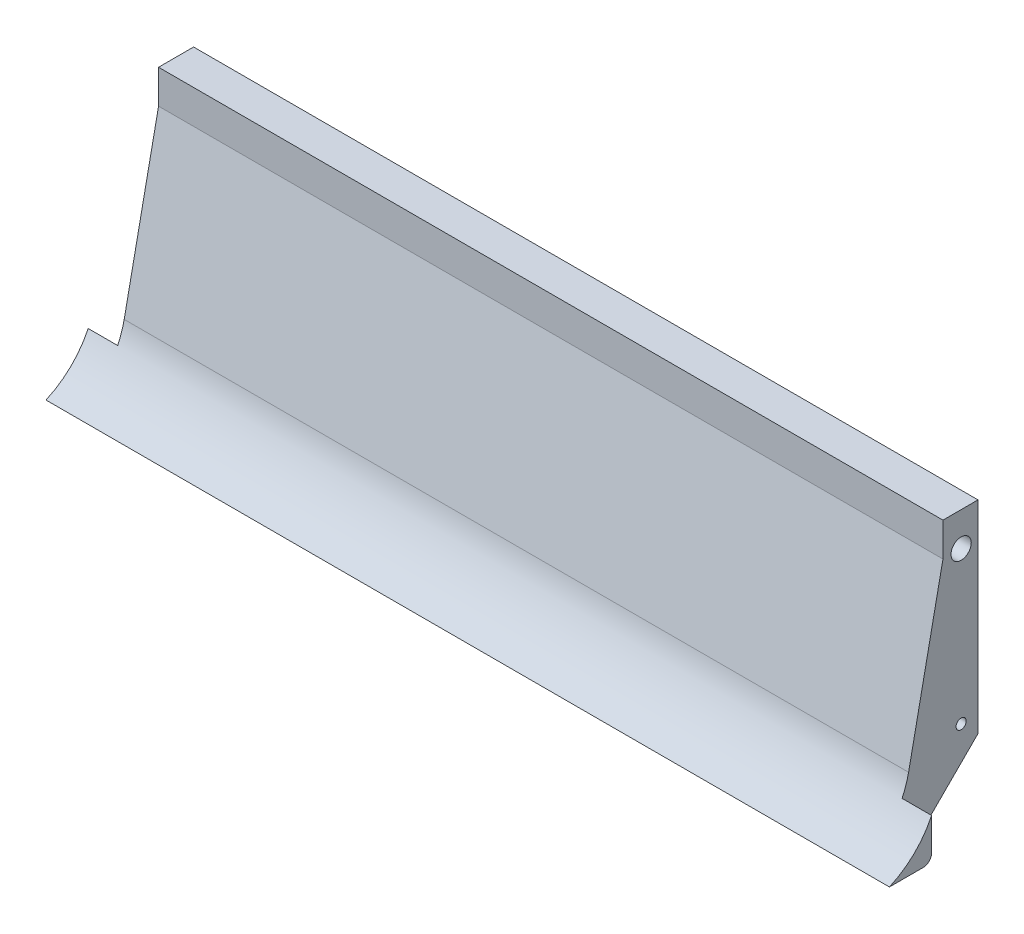
ISO-10303-21;
HEADER;
FILE_DESCRIPTION(('STEP AP214'),'2;1');
FILE_NAME('part.step','',(''),(''),'','','');
FILE_SCHEMA(('AUTOMOTIVE_DESIGN { 1 0 10303 214 1 1 1 1 }'));
ENDSEC;
DATA;
#1=APPLICATION_CONTEXT('core data for automotive mechanical design processes');
#2=APPLICATION_PROTOCOL_DEFINITION('international standard','automotive_design',2000,#1);
#3=PRODUCT_CONTEXT('',#1,'mechanical');
#4=PRODUCT('Part','Part','',(#3));
#5=PRODUCT_RELATED_PRODUCT_CATEGORY('part','',(#4));
#6=PRODUCT_DEFINITION_FORMATION('','',#4);
#7=PRODUCT_DEFINITION_CONTEXT('part definition',#1,'design');
#8=PRODUCT_DEFINITION('design','',#6,#7);
#9=PRODUCT_DEFINITION_SHAPE('','',#8);
#10=(LENGTH_UNIT() NAMED_UNIT(*) SI_UNIT(.MILLI.,.METRE.));
#11=(NAMED_UNIT(*) PLANE_ANGLE_UNIT() SI_UNIT($,.RADIAN.));
#12=(NAMED_UNIT(*) SI_UNIT($,.STERADIAN.) SOLID_ANGLE_UNIT());
#13=UNCERTAINTY_MEASURE_WITH_UNIT(LENGTH_MEASURE(1.E-05),#10,'distance_accuracy_value','');
#14=(GEOMETRIC_REPRESENTATION_CONTEXT(3) GLOBAL_UNCERTAINTY_ASSIGNED_CONTEXT((#13)) GLOBAL_UNIT_ASSIGNED_CONTEXT((#10,
#11,#12)) REPRESENTATION_CONTEXT('',''));
#15=CARTESIAN_POINT('',(0.,0.,0.));
#16=DIRECTION('',(0.,0.,1.));
#17=DIRECTION('',(1.,0.,0.));
#18=AXIS2_PLACEMENT_3D('',#15,#16,#17);
#19=CARTESIAN_POINT('',(0.,-8.95200122399586,15.5116568960203));
#20=DIRECTION('',(0.,-0.200951276235461,-0.97960123753461));
#21=DIRECTION('',(0.,0.97960123753461,-0.200951276235461));
#22=AXIS2_PLACEMENT_3D('',#19,#20,#21);
#23=PLANE('',#22);
#24=DIRECTION('',(1.,0.,0.));
#25=VECTOR('',#24,1.);
#26=CARTESIAN_POINT('',(0.,-3.05308900706619,14.3015788632727));
#27=LINE('',#26,#25);
#28=CARTESIAN_POINT('',(3.5,-3.05308900706619,14.3015788632727));
#29=VERTEX_POINT('',#28);
#30=CARTESIAN_POINT('',(96.5,-3.05308900706619,14.3015788632727));
#31=VERTEX_POINT('',#30);
#32=EDGE_CURVE('E161',#29,#31,#27,.T.);
#33=ORIENTED_EDGE('',*,*,#32,.T.);
#34=DIRECTION('',(0.,0.97960123753461,-0.200951276235461));
#35=VECTOR('',#34,1.);
#36=CARTESIAN_POINT('',(96.5,-8.95200122399586,15.5116568960203));
#37=LINE('',#36,#35);
#38=CARTESIAN_POINT('',(96.5,16.8022026708873,10.22854786879));
#39=VERTEX_POINT('',#38);
#40=EDGE_CURVE('E271',#31,#39,#37,.T.);
#41=ORIENTED_EDGE('',*,*,#40,.T.);
#42=DIRECTION('',(1.,0.,0.));
#43=VECTOR('',#42,1.);
#44=CARTESIAN_POINT('',(0.,16.8022026708873,10.22854786879));
#45=LINE('',#44,#43);
#46=CARTESIAN_POINT('',(3.5,16.8022026708873,10.22854786879));
#47=VERTEX_POINT('',#46);
#48=EDGE_CURVE('E177',#47,#39,#45,.T.);
#49=ORIENTED_EDGE('',*,*,#48,.F.);
#50=DIRECTION('',(0.,0.97960123753461,-0.200951276235461));
#51=VECTOR('',#50,1.);
#52=CARTESIAN_POINT('',(3.5,-8.95200122399586,15.5116568960203));
#53=LINE('',#52,#51);
#54=EDGE_CURVE('E222',#29,#47,#53,.T.);
#55=ORIENTED_EDGE('',*,*,#54,.F.);
#56=EDGE_LOOP('',(#33,#41,#49,#55));
#57=FACE_BOUND('',#56,.T.);
#58=ADVANCED_FACE('F33',(#57),#23,.F.);
#59=CARTESIAN_POINT('',(100.,-3.19779732911274,6.07263951991399));
#60=DIRECTION('',(0.,0.707106781186548,0.707106781186547));
#61=DIRECTION('',(-1.,0.,0.));
#62=AXIS2_PLACEMENT_3D('',#59,#60,#61);
#63=PLANE('',#62);
#64=DIRECTION('',(0.,-0.707106781186547,0.707106781186548));
#65=VECTOR('',#64,1.);
#66=CARTESIAN_POINT('',(96.5,-3.19779732911274,6.07263951991399));
#67=LINE('',#66,#65);
#68=CARTESIAN_POINT('',(96.5,-8.73333123504549,11.6081734258468));
#69=VERTEX_POINT('',#68);
#70=CARTESIAN_POINT('',(96.5,-3.19779732911273,6.07263951991399));
#71=VERTEX_POINT('',#70);
#72=EDGE_CURVE('E224',#69,#71,#67,.F.);
#73=ORIENTED_EDGE('',*,*,#72,.F.);
#74=DIRECTION('',(1.,0.,0.));
#75=VECTOR('',#74,1.);
#76=CARTESIAN_POINT('',(3.5,-8.73333123504549,11.6081734258467));
#77=LINE('',#76,#75);
#78=CARTESIAN_POINT('',(3.5,-8.73333123504549,11.6081734258468));
#79=VERTEX_POINT('',#78);
#80=EDGE_CURVE('E293',#69,#79,#77,.F.);
#81=ORIENTED_EDGE('',*,*,#80,.T.);
#82=DIRECTION('',(0.,-0.707106781186547,0.707106781186548));
#83=VECTOR('',#82,1.);
#84=CARTESIAN_POINT('',(3.5,-3.19779732911274,6.07263951991399));
#85=LINE('',#84,#83);
#86=CARTESIAN_POINT('',(3.5,-3.19779732911273,6.07263951991399));
#87=VERTEX_POINT('',#86);
#88=EDGE_CURVE('E220',#79,#87,#85,.F.);
#89=ORIENTED_EDGE('',*,*,#88,.T.);
#90=DIRECTION('',(-1.,0.,0.));
#91=VECTOR('',#90,1.);
#92=CARTESIAN_POINT('',(100.,-3.19779732911274,6.07263951991399));
#93=LINE('',#92,#91);
#94=EDGE_CURVE('E164',#71,#87,#93,.T.);
#95=ORIENTED_EDGE('',*,*,#94,.F.);
#96=EDGE_LOOP('',(#73,#81,#89,#95));
#97=FACE_BOUND('',#96,.T.);
#98=ADVANCED_FACE('F301',(#97),#63,.F.);
#99=CARTESIAN_POINT('',(100.,16.8022026708873,6.07263951991399));
#100=DIRECTION('',(0.,0.,1.));
#101=DIRECTION('',(0.,-1.,0.));
#102=AXIS2_PLACEMENT_3D('',#99,#100,#101);
#103=PLANE('',#102);
#104=ORIENTED_EDGE('',*,*,#94,.T.);
#105=DIRECTION('',(0.,-1.,0.));
#106=VECTOR('',#105,1.);
#107=CARTESIAN_POINT('',(3.5,20.8022026708873,6.07263951991399));
#108=LINE('',#107,#106);
#109=CARTESIAN_POINT('',(3.5,20.8022026708873,6.07263951991399));
#110=VERTEX_POINT('',#109);
#111=EDGE_CURVE('E236',#110,#87,#108,.T.);
#112=ORIENTED_EDGE('',*,*,#111,.F.);
#113=DIRECTION('',(-1.,0.,0.));
#114=VECTOR('',#113,1.);
#115=CARTESIAN_POINT('',(1.14789806156068,20.8022026708873,6.07263951991399));
#116=LINE('',#115,#114);
#117=CARTESIAN_POINT('',(96.5,20.8022026708873,6.07263951991399));
#118=VERTEX_POINT('',#117);
#119=EDGE_CURVE('E182',#118,#110,#116,.T.);
#120=ORIENTED_EDGE('',*,*,#119,.F.);
#121=DIRECTION('',(0.,1.,0.));
#122=VECTOR('',#121,1.);
#123=CARTESIAN_POINT('',(96.5,20.8022026708873,6.07263951991399));
#124=LINE('',#123,#122);
#125=EDGE_CURVE('E245',#71,#118,#124,.T.);
#126=ORIENTED_EDGE('',*,*,#125,.F.);
#127=EDGE_LOOP('',(#104,#112,#120,#126));
#128=FACE_BOUND('',#127,.T.);
#129=ADVANCED_FACE('F261',(#128),#103,.F.);
#130=CARTESIAN_POINT('',(1.14789806156068,20.8022026708873,10.22854786879));
#131=DIRECTION('',(0.,0.,-1.));
#132=DIRECTION('',(-1.,0.,0.));
#133=AXIS2_PLACEMENT_3D('',#130,#131,#132);
#134=PLANE('',#133);
#135=DIRECTION('',(1.,0.,0.));
#136=VECTOR('',#135,1.);
#137=CARTESIAN_POINT('',(1.14789806156068,20.8022026708873,10.22854786879));
#138=LINE('',#137,#136);
#139=CARTESIAN_POINT('',(3.5,20.8022026708873,10.22854786879));
#140=VERTEX_POINT('',#139);
#141=CARTESIAN_POINT('',(96.5,20.8022026708873,10.22854786879));
#142=VERTEX_POINT('',#141);
#143=EDGE_CURVE('E250',#140,#142,#138,.T.);
#144=ORIENTED_EDGE('',*,*,#143,.F.);
#145=DIRECTION('',(0.,1.,0.));
#146=VECTOR('',#145,1.);
#147=CARTESIAN_POINT('',(3.5,20.8022026708873,10.22854786879));
#148=LINE('',#147,#146);
#149=EDGE_CURVE('E232',#47,#140,#148,.T.);
#150=ORIENTED_EDGE('',*,*,#149,.F.);
#151=ORIENTED_EDGE('',*,*,#48,.T.);
#152=DIRECTION('',(0.,-1.,0.));
#153=VECTOR('',#152,1.);
#154=CARTESIAN_POINT('',(96.5,20.8022026708873,10.22854786879));
#155=LINE('',#154,#153);
#156=EDGE_CURVE('E242',#142,#39,#155,.T.);
#157=ORIENTED_EDGE('',*,*,#156,.F.);
#158=EDGE_LOOP('',(#144,#150,#151,#157));
#159=FACE_BOUND('',#158,.T.);
#160=ADVANCED_FACE('F267',(#159),#134,.F.);
#161=CARTESIAN_POINT('',(0.,20.8022026708873,0.));
#162=DIRECTION('',(0.,1.,0.));
#163=DIRECTION('',(0.,0.,1.));
#164=AXIS2_PLACEMENT_3D('',#161,#162,#163);
#165=PLANE('',#164);
#166=DIRECTION('',(0.,0.,-1.));
#167=VECTOR('',#166,1.);
#168=CARTESIAN_POINT('',(3.5,20.8022026708873,10.22854786879));
#169=LINE('',#168,#167);
#170=EDGE_CURVE('E234',#140,#110,#169,.T.);
#171=ORIENTED_EDGE('',*,*,#170,.F.);
#172=ORIENTED_EDGE('',*,*,#143,.T.);
#173=DIRECTION('',(0.,0.,1.));
#174=VECTOR('',#173,1.);
#175=CARTESIAN_POINT('',(96.5,20.8022026708873,10.22854786879));
#176=LINE('',#175,#174);
#177=EDGE_CURVE('E176',#118,#142,#176,.T.);
#178=ORIENTED_EDGE('',*,*,#177,.F.);
#179=ORIENTED_EDGE('',*,*,#119,.T.);
#180=EDGE_LOOP('',(#171,#172,#178,#179));
#181=FACE_BOUND('',#180,.T.);
#182=ADVANCED_FACE('F257',(#181),#165,.T.);
#183=CARTESIAN_POINT('',(0.,16.8022026708873,8.07263951991399));
#184=DIRECTION('',(1.,0.,0.));
#185=DIRECTION('',(0.,0.,-1.));
#186=AXIS2_PLACEMENT_3D('',#183,#184,#185);
#187=CYLINDRICAL_SURFACE('',#186,1.2);
#188=CARTESIAN_POINT('',(3.5,16.8022026708873,8.07263951991399));
#189=DIRECTION('',(1.,0.,0.));
#190=DIRECTION('',(0.,0.,-1.));
#191=AXIS2_PLACEMENT_3D('',#188,#189,#190);
#192=CIRCLE('',#191,1.2);
#193=CARTESIAN_POINT('',(3.5,16.8022026708873,6.87263951991399));
#194=VERTEX_POINT('',#193);
#195=EDGE_CURVE('E239',#194,#194,#192,.F.);
#196=ORIENTED_EDGE('',*,*,#195,.T.);
#197=EDGE_LOOP('',(#196));
#198=FACE_BOUND('',#197,.T.);
#199=CARTESIAN_POINT('',(96.5,16.8022026708873,8.07263951991399));
#200=DIRECTION('',(1.,0.,0.));
#201=DIRECTION('',(0.,0.,-1.));
#202=AXIS2_PLACEMENT_3D('',#199,#200,#201);
#203=CIRCLE('',#202,1.2);
#204=CARTESIAN_POINT('',(96.5,16.8022026708873,6.87263951991399));
#205=VERTEX_POINT('',#204);
#206=EDGE_CURVE('E175',#205,#205,#203,.F.);
#207=ORIENTED_EDGE('',*,*,#206,.F.);
#208=EDGE_LOOP('',(#207));
#209=FACE_BOUND('',#208,.T.);
#210=ADVANCED_FACE('F344',(#198,#209),#187,.F.);
#211=CARTESIAN_POINT('',(0.,-1.19779732911275,8.07263951991399));
#212=DIRECTION('',(1.,0.,0.));
#213=DIRECTION('',(0.,0.,-1.));
#214=AXIS2_PLACEMENT_3D('',#211,#212,#213);
#215=CYLINDRICAL_SURFACE('',#214,0.6);
#216=CARTESIAN_POINT('',(3.5,-1.19779732911275,8.07263951991399));
#217=DIRECTION('',(1.,0.,0.));
#218=DIRECTION('',(0.,0.,-1.));
#219=AXIS2_PLACEMENT_3D('',#216,#217,#218);
#220=CIRCLE('',#219,0.6);
#221=CARTESIAN_POINT('',(3.5,-1.19779732911275,7.47263951991399));
#222=VERTEX_POINT('',#221);
#223=EDGE_CURVE('E183',#222,#222,#220,.F.);
#224=ORIENTED_EDGE('',*,*,#223,.T.);
#225=EDGE_LOOP('',(#224));
#226=FACE_BOUND('',#225,.T.);
#227=CARTESIAN_POINT('',(96.5,-1.19779732911275,8.07263951991399));
#228=DIRECTION('',(1.,0.,0.));
#229=DIRECTION('',(0.,0.,-1.));
#230=AXIS2_PLACEMENT_3D('',#227,#228,#229);
#231=CIRCLE('',#230,0.6);
#232=CARTESIAN_POINT('',(96.5,-1.19779732911275,7.47263951991399));
#233=VERTEX_POINT('',#232);
#234=EDGE_CURVE('E172',#233,#233,#231,.F.);
#235=ORIENTED_EDGE('',*,*,#234,.F.);
#236=EDGE_LOOP('',(#235));
#237=FACE_BOUND('',#236,.T.);
#238=ADVANCED_FACE('F328',(#226,#237),#215,.F.);
#239=CARTESIAN_POINT('',(100.,-10.1977973291127,20.072639519914));
#240=DIRECTION('',(0.,1.,0.));
#241=DIRECTION('',(0.,0.,1.));
#242=AXIS2_PLACEMENT_3D('',#239,#240,#241);
#243=PLANE('',#242);
#244=DIRECTION('',(0.,0.,-1.));
#245=VECTOR('',#244,1.);
#246=CARTESIAN_POINT('',(0.,-10.1977973291127,20.072639519914));
#247=LINE('',#246,#245);
#248=CARTESIAN_POINT('',(0.,-10.1977973291127,20.072639519914));
#249=VERTEX_POINT('',#248);
#250=CARTESIAN_POINT('',(0.,-10.1977973291127,16.072639519914));
#251=VERTEX_POINT('',#250);
#252=EDGE_CURVE('E181',#249,#251,#247,.T.);
#253=ORIENTED_EDGE('',*,*,#252,.T.);
#254=DIRECTION('',(-1.,0.,0.));
#255=VECTOR('',#254,1.);
#256=CARTESIAN_POINT('',(100.,-10.1977973291127,16.072639519914));
#257=LINE('',#256,#255);
#258=CARTESIAN_POINT('',(3.5,-10.1977973291127,16.072639519914));
#259=VERTEX_POINT('',#258);
#260=EDGE_CURVE('E41',#251,#259,#257,.F.);
#261=ORIENTED_EDGE('',*,*,#260,.T.);
#262=DIRECTION('',(0.,0.,-1.));
#263=VECTOR('',#262,1.);
#264=CARTESIAN_POINT('',(3.5,-10.1977973291127,20.072639519914));
#265=LINE('',#264,#263);
#266=CARTESIAN_POINT('',(3.5,-10.1977973291127,15.1437073317795));
#267=VERTEX_POINT('',#266);
#268=EDGE_CURVE('E47',#259,#267,#265,.T.);
#269=ORIENTED_EDGE('',*,*,#268,.T.);
#270=DIRECTION('',(-1.,0.,0.));
#271=VECTOR('',#270,1.);
#272=CARTESIAN_POINT('',(96.5,-10.1977973291127,15.1437073317795));
#273=LINE('',#272,#271);
#274=CARTESIAN_POINT('',(96.5,-10.1977973291127,15.1437073317795));
#275=VERTEX_POINT('',#274);
#276=EDGE_CURVE('E144',#267,#275,#273,.F.);
#277=ORIENTED_EDGE('',*,*,#276,.T.);
#278=DIRECTION('',(0.,0.,1.));
#279=VECTOR('',#278,1.);
#280=CARTESIAN_POINT('',(96.5,-10.1977973291127,0.));
#281=LINE('',#280,#279);
#282=CARTESIAN_POINT('',(96.5,-10.1977973291127,16.072639519914));
#283=VERTEX_POINT('',#282);
#284=EDGE_CURVE('E280',#275,#283,#281,.T.);
#285=ORIENTED_EDGE('',*,*,#284,.T.);
#286=DIRECTION('',(-1.,0.,0.));
#287=VECTOR('',#286,1.);
#288=CARTESIAN_POINT('',(100.,-10.1977973291127,16.072639519914));
#289=LINE('',#288,#287);
#290=CARTESIAN_POINT('',(100.,-10.1977973291127,16.072639519914));
#291=VERTEX_POINT('',#290);
#292=EDGE_CURVE('E283',#283,#291,#289,.F.);
#293=ORIENTED_EDGE('',*,*,#292,.T.);
#294=DIRECTION('',(0.,0.,-1.));
#295=VECTOR('',#294,1.);
#296=CARTESIAN_POINT('',(100.,-10.1977973291127,20.072639519914));
#297=LINE('',#296,#295);
#298=CARTESIAN_POINT('',(100.,-10.1977973291127,20.072639519914));
#299=VERTEX_POINT('',#298);
#300=EDGE_CURVE('E189',#299,#291,#297,.T.);
#301=ORIENTED_EDGE('',*,*,#300,.F.);
#302=DIRECTION('',(-1.,0.,0.));
#303=VECTOR('',#302,1.);
#304=CARTESIAN_POINT('',(100.,-10.1977973291127,20.072639519914));
#305=LINE('',#304,#303);
#306=EDGE_CURVE('E159',#299,#249,#305,.T.);
#307=ORIENTED_EDGE('',*,*,#306,.T.);
#308=EDGE_LOOP('',(#253,#261,#269,#277,#285,#293,#301,#307));
#309=FACE_BOUND('',#308,.T.);
#310=ADVANCED_FACE('F193',(#309),#243,.F.);
#311=CARTESIAN_POINT('',(100.,0.,0.));
#312=DIRECTION('',(1.,0.,0.));
#313=DIRECTION('',(0.,0.,-1.));
#314=AXIS2_PLACEMENT_3D('',#311,#312,#313);
#315=PLANE('',#314);
#316=ORIENTED_EDGE('',*,*,#300,.T.);
#317=CARTESIAN_POINT('',(100.,-9.19779732911275,16.072639519914));
#318=DIRECTION('',(1.,0.,0.));
#319=DIRECTION('',(0.,0.,-1.));
#320=AXIS2_PLACEMENT_3D('',#317,#318,#319);
#321=CIRCLE('',#320,1.);
#322=CARTESIAN_POINT('',(100.,-9.19779732911275,15.072639519914));
#323=VERTEX_POINT('',#322);
#324=EDGE_CURVE('E153',#291,#323,#321,.T.);
#325=ORIENTED_EDGE('',*,*,#324,.T.);
#326=DIRECTION('',(0.,-1.,0.));
#327=VECTOR('',#326,1.);
#328=CARTESIAN_POINT('',(100.,-10.1977973291127,15.072639519914));
#329=LINE('',#328,#327);
#330=CARTESIAN_POINT('',(100.,-5.3505759515895,15.072639519914));
#331=VERTEX_POINT('',#330);
#332=EDGE_CURVE('E137',#331,#323,#329,.T.);
#333=ORIENTED_EDGE('',*,*,#332,.F.);
#334=CARTESIAN_POINT('',(100.,-1.04357624471157,24.0975912386188));
#335=DIRECTION('',(1.,0.,0.));
#336=DIRECTION('',(0.,0.,-1.));
#337=AXIS2_PLACEMENT_3D('',#334,#335,#336);
#338=CIRCLE('',#337,10.);
#339=EDGE_CURVE('E150',#331,#299,#338,.F.);
#340=ORIENTED_EDGE('',*,*,#339,.T.);
#341=EDGE_LOOP('',(#316,#325,#333,#340));
#342=FACE_BOUND('',#341,.T.);
#343=ADVANCED_FACE('F149',(#342),#315,.T.);
#344=CARTESIAN_POINT('',(0.,0.,0.));
#345=DIRECTION('',(1.,0.,0.));
#346=DIRECTION('',(0.,0.,-1.));
#347=AXIS2_PLACEMENT_3D('',#344,#345,#346);
#348=PLANE('',#347);
#349=DIRECTION('',(0.,1.,0.));
#350=VECTOR('',#349,1.);
#351=CARTESIAN_POINT('',(0.,-10.1977973291127,15.072639519914));
#352=LINE('',#351,#350);
#353=CARTESIAN_POINT('',(0.,-9.19779732911275,15.072639519914));
#354=VERTEX_POINT('',#353);
#355=CARTESIAN_POINT('',(0.,-5.3505759515895,15.072639519914));
#356=VERTEX_POINT('',#355);
#357=EDGE_CURVE('E201',#354,#356,#352,.T.);
#358=ORIENTED_EDGE('',*,*,#357,.F.);
#359=CARTESIAN_POINT('',(0.,-9.19779732911275,16.072639519914));
#360=DIRECTION('',(1.,0.,0.));
#361=DIRECTION('',(0.,0.,-1.));
#362=AXIS2_PLACEMENT_3D('',#359,#360,#361);
#363=CIRCLE('',#362,1.);
#364=EDGE_CURVE('E202',#354,#251,#363,.F.);
#365=ORIENTED_EDGE('',*,*,#364,.T.);
#366=ORIENTED_EDGE('',*,*,#252,.F.);
#367=CARTESIAN_POINT('',(0.,-1.04357624471157,24.0975912386188));
#368=DIRECTION('',(1.,0.,0.));
#369=DIRECTION('',(0.,0.,-1.));
#370=AXIS2_PLACEMENT_3D('',#367,#368,#369);
#371=CIRCLE('',#370,10.);
#372=EDGE_CURVE('E160',#249,#356,#371,.T.);
#373=ORIENTED_EDGE('',*,*,#372,.T.);
#374=EDGE_LOOP('',(#358,#365,#366,#373));
#375=FACE_BOUND('',#374,.T.);
#376=ADVANCED_FACE('F200',(#375),#348,.F.);
#377=CARTESIAN_POINT('',(0.,-1.04357624471157,24.0975912386188));
#378=DIRECTION('',(1.,0.,0.));
#379=DIRECTION('',(0.,0.,-1.));
#380=AXIS2_PLACEMENT_3D('',#377,#378,#379);
#381=CYLINDRICAL_SURFACE('',#380,10.);
#382=ORIENTED_EDGE('',*,*,#339,.F.);
#383=DIRECTION('',(1.,0.,0.));
#384=VECTOR('',#383,1.);
#385=CARTESIAN_POINT('',(0.,-5.3505759515895,15.072639519914));
#386=LINE('',#385,#384);
#387=CARTESIAN_POINT('',(96.5,-5.3505759515895,15.072639519914));
#388=VERTEX_POINT('',#387);
#389=EDGE_CURVE('E133',#331,#388,#386,.F.);
#390=ORIENTED_EDGE('',*,*,#389,.T.);
#391=CARTESIAN_POINT('',(96.5,-1.04357624471157,24.0975912386188));
#392=DIRECTION('',(-1.,0.,0.));
#393=DIRECTION('',(0.,0.,1.));
#394=AXIS2_PLACEMENT_3D('',#391,#392,#393);
#395=CIRCLE('',#394,10.);
#396=EDGE_CURVE('E273',#388,#31,#395,.F.);
#397=ORIENTED_EDGE('',*,*,#396,.T.);
#398=ORIENTED_EDGE('',*,*,#32,.F.);
#399=CARTESIAN_POINT('',(3.5,-1.04357624471157,24.0975912386188));
#400=DIRECTION('',(-1.,0.,0.));
#401=DIRECTION('',(0.,0.,1.));
#402=AXIS2_PLACEMENT_3D('',#399,#400,#401);
#403=CIRCLE('',#402,10.);
#404=CARTESIAN_POINT('',(3.5,-5.3505759515895,15.072639519914));
#405=VERTEX_POINT('',#404);
#406=EDGE_CURVE('E230',#405,#29,#403,.F.);
#407=ORIENTED_EDGE('',*,*,#406,.F.);
#408=DIRECTION('',(1.,0.,0.));
#409=VECTOR('',#408,1.);
#410=CARTESIAN_POINT('',(0.,-5.3505759515895,15.072639519914));
#411=LINE('',#410,#409);
#412=EDGE_CURVE('E145',#405,#356,#411,.F.);
#413=ORIENTED_EDGE('',*,*,#412,.T.);
#414=ORIENTED_EDGE('',*,*,#372,.F.);
#415=ORIENTED_EDGE('',*,*,#306,.F.);
#416=EDGE_LOOP('',(#382,#390,#397,#398,#407,#413,#414,#415));
#417=FACE_BOUND('',#416,.T.);
#418=ADVANCED_FACE('F156',(#417),#381,.F.);
#419=CARTESIAN_POINT('',(96.5,0.,0.));
#420=DIRECTION('',(1.,0.,0.));
#421=DIRECTION('',(0.,0.,-1.));
#422=AXIS2_PLACEMENT_3D('',#419,#420,#421);
#423=PLANE('',#422);
#424=ORIENTED_EDGE('',*,*,#234,.T.);
#425=EDGE_LOOP('',(#424));
#426=FACE_BOUND('',#425,.T.);
#427=DIRECTION('',(0.,-1.,0.));
#428=VECTOR('',#427,1.);
#429=CARTESIAN_POINT('',(96.5,-10.1977973291127,15.072639519914));
#430=LINE('',#429,#428);
#431=CARTESIAN_POINT('',(96.5,-9.19779732911275,15.072639519914));
#432=VERTEX_POINT('',#431);
#433=EDGE_CURVE('E140',#388,#432,#430,.T.);
#434=ORIENTED_EDGE('',*,*,#433,.T.);
#435=CARTESIAN_POINT('',(96.5,-9.19779732911275,16.072639519914));
#436=DIRECTION('',(1.,0.,0.));
#437=DIRECTION('',(0.,0.,-1.));
#438=AXIS2_PLACEMENT_3D('',#435,#436,#437);
#439=CIRCLE('',#438,1.);
#440=EDGE_CURVE('E209',#432,#283,#439,.F.);
#441=ORIENTED_EDGE('',*,*,#440,.T.);
#442=ORIENTED_EDGE('',*,*,#284,.F.);
#443=CARTESIAN_POINT('',(96.5,-5.19779732911275,15.1437073317795));
#444=DIRECTION('',(1.,0.,0.));
#445=DIRECTION('',(0.,0.,-1.));
#446=AXIS2_PLACEMENT_3D('',#443,#444,#445);
#447=CIRCLE('',#446,5.);
#448=EDGE_CURVE('E295',#275,#69,#447,.T.);
#449=ORIENTED_EDGE('',*,*,#448,.T.);
#450=ORIENTED_EDGE('',*,*,#72,.T.);
#451=ORIENTED_EDGE('',*,*,#125,.T.);
#452=ORIENTED_EDGE('',*,*,#177,.T.);
#453=ORIENTED_EDGE('',*,*,#156,.T.);
#454=ORIENTED_EDGE('',*,*,#40,.F.);
#455=ORIENTED_EDGE('',*,*,#396,.F.);
#456=EDGE_LOOP('',(#434,#441,#442,#449,#450,#451,#452,#453,#454,#455));
#457=FACE_BOUND('',#456,.T.);
#458=ORIENTED_EDGE('',*,*,#206,.T.);
#459=EDGE_LOOP('',(#458));
#460=FACE_BOUND('',#459,.T.);
#461=ADVANCED_FACE('F276',(#426,#457,#460),#423,.T.);
#462=CARTESIAN_POINT('',(3.5,0.,0.));
#463=DIRECTION('',(1.,0.,0.));
#464=DIRECTION('',(0.,0.,-1.));
#465=AXIS2_PLACEMENT_3D('',#462,#463,#464);
#466=PLANE('',#465);
#467=ORIENTED_EDGE('',*,*,#88,.F.);
#468=CARTESIAN_POINT('',(3.5,-5.19779732911275,15.1437073317795));
#469=DIRECTION('',(1.,0.,0.));
#470=DIRECTION('',(0.,0.,-1.));
#471=AXIS2_PLACEMENT_3D('',#468,#469,#470);
#472=CIRCLE('',#471,5.);
#473=EDGE_CURVE('E52',#79,#267,#472,.F.);
#474=ORIENTED_EDGE('',*,*,#473,.T.);
#475=ORIENTED_EDGE('',*,*,#268,.F.);
#476=CARTESIAN_POINT('',(3.5,-9.19779732911275,16.072639519914));
#477=DIRECTION('',(1.,0.,0.));
#478=DIRECTION('',(0.,0.,-1.));
#479=AXIS2_PLACEMENT_3D('',#476,#477,#478);
#480=CIRCLE('',#479,1.);
#481=CARTESIAN_POINT('',(3.5,-9.19779732911275,15.072639519914));
#482=VERTEX_POINT('',#481);
#483=EDGE_CURVE('E11',#259,#482,#480,.T.);
#484=ORIENTED_EDGE('',*,*,#483,.T.);
#485=DIRECTION('',(0.,1.,0.));
#486=VECTOR('',#485,1.);
#487=CARTESIAN_POINT('',(3.5,-10.1977973291127,15.072639519914));
#488=LINE('',#487,#486);
#489=EDGE_CURVE('E217',#482,#405,#488,.T.);
#490=ORIENTED_EDGE('',*,*,#489,.T.);
#491=ORIENTED_EDGE('',*,*,#406,.T.);
#492=ORIENTED_EDGE('',*,*,#54,.T.);
#493=ORIENTED_EDGE('',*,*,#149,.T.);
#494=ORIENTED_EDGE('',*,*,#170,.T.);
#495=ORIENTED_EDGE('',*,*,#111,.T.);
#496=EDGE_LOOP('',(#467,#474,#475,#484,#490,#491,#492,#493,#494,#495));
#497=FACE_BOUND('',#496,.T.);
#498=ORIENTED_EDGE('',*,*,#223,.F.);
#499=EDGE_LOOP('',(#498));
#500=FACE_BOUND('',#499,.T.);
#501=ORIENTED_EDGE('',*,*,#195,.F.);
#502=EDGE_LOOP('',(#501));
#503=FACE_BOUND('',#502,.T.);
#504=ADVANCED_FACE('F215',(#497,#500,#503),#466,.F.);
#505=CARTESIAN_POINT('',(3.5,-10.1977973291127,15.072639519914));
#506=DIRECTION('',(0.,0.,1.));
#507=DIRECTION('',(1.,0.,0.));
#508=AXIS2_PLACEMENT_3D('',#505,#506,#507);
#509=PLANE('',#508);
#510=ORIENTED_EDGE('',*,*,#489,.F.);
#511=DIRECTION('',(-1.,0.,0.));
#512=VECTOR('',#511,1.);
#513=CARTESIAN_POINT('',(3.5,-9.19779732911275,15.072639519914));
#514=LINE('',#513,#512);
#515=EDGE_CURVE('E206',#482,#354,#514,.T.);
#516=ORIENTED_EDGE('',*,*,#515,.T.);
#517=ORIENTED_EDGE('',*,*,#357,.T.);
#518=ORIENTED_EDGE('',*,*,#412,.F.);
#519=EDGE_LOOP('',(#510,#516,#517,#518));
#520=FACE_BOUND('',#519,.T.);
#521=ADVANCED_FACE('F219',(#520),#509,.F.);
#522=CARTESIAN_POINT('',(96.5,-10.1977973291127,15.072639519914));
#523=DIRECTION('',(0.,0.,1.));
#524=DIRECTION('',(1.,0.,0.));
#525=AXIS2_PLACEMENT_3D('',#522,#523,#524);
#526=PLANE('',#525);
#527=ORIENTED_EDGE('',*,*,#332,.T.);
#528=DIRECTION('',(-1.,0.,0.));
#529=VECTOR('',#528,1.);
#530=CARTESIAN_POINT('',(96.5,-9.19779732911275,15.072639519914));
#531=LINE('',#530,#529);
#532=EDGE_CURVE('E287',#323,#432,#531,.T.);
#533=ORIENTED_EDGE('',*,*,#532,.T.);
#534=ORIENTED_EDGE('',*,*,#433,.F.);
#535=ORIENTED_EDGE('',*,*,#389,.F.);
#536=EDGE_LOOP('',(#527,#533,#534,#535));
#537=FACE_BOUND('',#536,.T.);
#538=ADVANCED_FACE('F135',(#537),#526,.F.);
#539=CARTESIAN_POINT('',(100.,-5.19779732911275,15.1437073317795));
#540=DIRECTION('',(1.,0.,0.));
#541=DIRECTION('',(0.,0.,-1.));
#542=AXIS2_PLACEMENT_3D('',#539,#540,#541);
#543=CYLINDRICAL_SURFACE('',#542,5.);
#544=ORIENTED_EDGE('',*,*,#276,.F.);
#545=ORIENTED_EDGE('',*,*,#473,.F.);
#546=ORIENTED_EDGE('',*,*,#80,.F.);
#547=ORIENTED_EDGE('',*,*,#448,.F.);
#548=EDGE_LOOP('',(#544,#545,#546,#547));
#549=FACE_BOUND('',#548,.T.);
#550=ADVANCED_FACE('F302',(#549),#543,.T.);
#551=CARTESIAN_POINT('',(96.5,-9.19779732911275,16.072639519914));
#552=DIRECTION('',(-1.,0.,0.));
#553=DIRECTION('',(0.,0.,1.));
#554=AXIS2_PLACEMENT_3D('',#551,#552,#553);
#555=CYLINDRICAL_SURFACE('',#554,1.);
#556=ORIENTED_EDGE('',*,*,#324,.F.);
#557=ORIENTED_EDGE('',*,*,#292,.F.);
#558=ORIENTED_EDGE('',*,*,#440,.F.);
#559=ORIENTED_EDGE('',*,*,#532,.F.);
#560=EDGE_LOOP('',(#556,#557,#558,#559));
#561=FACE_BOUND('',#560,.T.);
#562=ADVANCED_FACE('F286',(#561),#555,.T.);
#563=CARTESIAN_POINT('',(3.5,-9.19779732911275,16.072639519914));
#564=DIRECTION('',(-1.,0.,0.));
#565=DIRECTION('',(0.,0.,1.));
#566=AXIS2_PLACEMENT_3D('',#563,#564,#565);
#567=CYLINDRICAL_SURFACE('',#566,1.);
#568=ORIENTED_EDGE('',*,*,#483,.F.);
#569=ORIENTED_EDGE('',*,*,#260,.F.);
#570=ORIENTED_EDGE('',*,*,#364,.F.);
#571=ORIENTED_EDGE('',*,*,#515,.F.);
#572=EDGE_LOOP('',(#568,#569,#570,#571));
#573=FACE_BOUND('',#572,.T.);
#574=ADVANCED_FACE('F35',(#573),#567,.T.);
#575=CLOSED_SHELL('',(#58,#98,#129,#160,#182,#210,#238,#310,#343,#376,#418,#461,#504,#521,#538,
#550,#562,#574));
#576=MANIFOLD_SOLID_BREP('B2',#575);
#577=ADVANCED_BREP_SHAPE_REPRESENTATION('',(#18,#576),#14);
#578=SHAPE_DEFINITION_REPRESENTATION(#9,#577);
ENDSEC;
END-ISO-10303-21;
